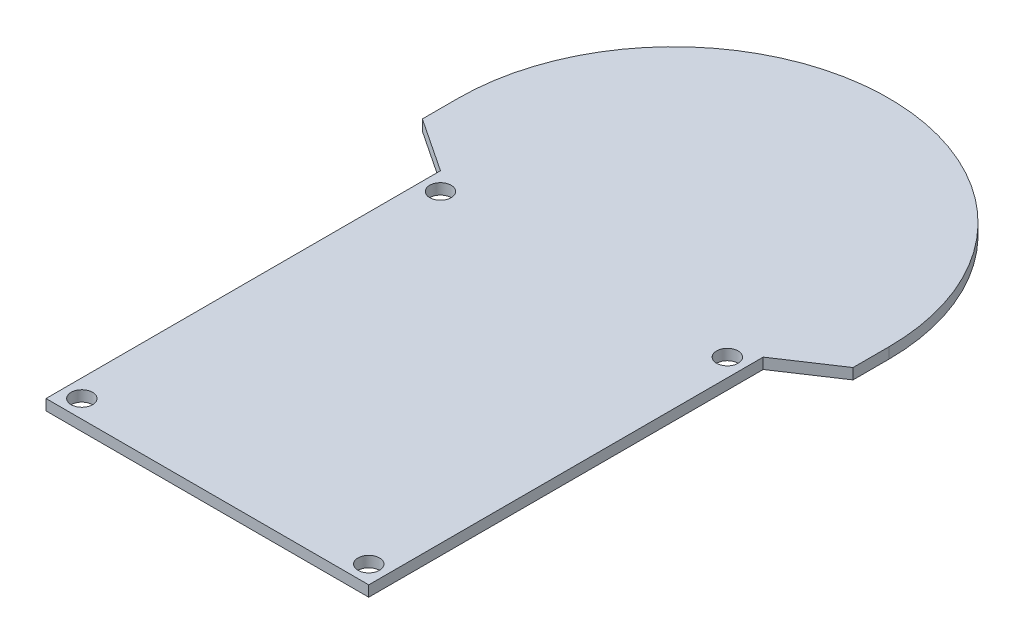
ISO-10303-21;
HEADER;
FILE_DESCRIPTION(('STEP AP214'),'2;1');
FILE_NAME('part.step','',(''),(''),'','','');
FILE_SCHEMA(('AUTOMOTIVE_DESIGN { 1 0 10303 214 1 1 1 1 }'));
ENDSEC;
DATA;
#1=APPLICATION_CONTEXT('core data for automotive mechanical design processes');
#2=APPLICATION_PROTOCOL_DEFINITION('international standard','automotive_design',2000,#1);
#3=PRODUCT_CONTEXT('',#1,'mechanical');
#4=PRODUCT('Part','Part','',(#3));
#5=PRODUCT_RELATED_PRODUCT_CATEGORY('part','',(#4));
#6=PRODUCT_DEFINITION_FORMATION('','',#4);
#7=PRODUCT_DEFINITION_CONTEXT('part definition',#1,'design');
#8=PRODUCT_DEFINITION('design','',#6,#7);
#9=PRODUCT_DEFINITION_SHAPE('','',#8);
#10=(LENGTH_UNIT() NAMED_UNIT(*) SI_UNIT(.MILLI.,.METRE.));
#11=(NAMED_UNIT(*) PLANE_ANGLE_UNIT() SI_UNIT($,.RADIAN.));
#12=(NAMED_UNIT(*) SI_UNIT($,.STERADIAN.) SOLID_ANGLE_UNIT());
#13=UNCERTAINTY_MEASURE_WITH_UNIT(LENGTH_MEASURE(1.E-05),#10,'distance_accuracy_value','');
#14=(GEOMETRIC_REPRESENTATION_CONTEXT(3) GLOBAL_UNCERTAINTY_ASSIGNED_CONTEXT((#13)) GLOBAL_UNIT_ASSIGNED_CONTEXT((#10,
#11,#12)) REPRESENTATION_CONTEXT('',''));
#15=CARTESIAN_POINT('',(0.,0.,0.));
#16=DIRECTION('',(0.,0.,1.));
#17=DIRECTION('',(1.,0.,0.));
#18=AXIS2_PLACEMENT_3D('',#15,#16,#17);
#19=CARTESIAN_POINT('',(7.5,1.5,22.5));
#20=DIRECTION('',(-1.,0.,0.));
#21=DIRECTION('',(0.,0.,1.));
#22=AXIS2_PLACEMENT_3D('',#19,#20,#21);
#23=PLANE('',#22);
#24=DIRECTION('',(0.,0.,-1.));
#25=VECTOR('',#24,1.);
#26=CARTESIAN_POINT('',(7.5,0.,22.5));
#27=LINE('',#26,#25);
#28=CARTESIAN_POINT('',(7.5,0.,22.5));
#29=VERTEX_POINT('',#28);
#30=CARTESIAN_POINT('',(7.50000000000001,0.,-32.5));
#31=VERTEX_POINT('',#30);
#32=EDGE_CURVE('E131',#29,#31,#27,.T.);
#33=ORIENTED_EDGE('',*,*,#32,.T.);
#34=DIRECTION('',(0.,-1.,0.));
#35=VECTOR('',#34,1.);
#36=CARTESIAN_POINT('',(7.50000000000001,1.5,-32.5));
#37=LINE('',#36,#35);
#38=CARTESIAN_POINT('',(7.50000000000001,1.5,-32.5));
#39=VERTEX_POINT('',#38);
#40=EDGE_CURVE('E11',#39,#31,#37,.T.);
#41=ORIENTED_EDGE('',*,*,#40,.F.);
#42=DIRECTION('',(0.,0.,-1.));
#43=VECTOR('',#42,1.);
#44=CARTESIAN_POINT('',(7.5,1.5,22.5));
#45=LINE('',#44,#43);
#46=CARTESIAN_POINT('',(7.5,1.5,22.5));
#47=VERTEX_POINT('',#46);
#48=EDGE_CURVE('E146',#47,#39,#45,.T.);
#49=ORIENTED_EDGE('',*,*,#48,.F.);
#50=DIRECTION('',(0.,-1.,0.));
#51=VECTOR('',#50,1.);
#52=CARTESIAN_POINT('',(7.5,1.5,22.5));
#53=LINE('',#52,#51);
#54=EDGE_CURVE('E127',#47,#29,#53,.T.);
#55=ORIENTED_EDGE('',*,*,#54,.T.);
#56=EDGE_LOOP('',(#33,#41,#49,#55));
#57=FACE_BOUND('',#56,.T.);
#58=ADVANCED_FACE('F35',(#57),#23,.F.);
#59=CARTESIAN_POINT('',(15.021006533252,1.5,-37.5));
#60=DIRECTION('',(-0.553626217534285,0.,-0.832765279810993));
#61=DIRECTION('',(-0.832765279810993,0.,0.553626217534285));
#62=AXIS2_PLACEMENT_3D('',#59,#60,#61);
#63=PLANE('',#62);
#64=DIRECTION('',(0.832765279810993,0.,-0.553626217534285));
#65=VECTOR('',#64,1.);
#66=CARTESIAN_POINT('',(15.021006533252,0.,-37.5));
#67=LINE('',#66,#65);
#68=CARTESIAN_POINT('',(15.021006533252,0.,-37.5));
#69=VERTEX_POINT('',#68);
#70=EDGE_CURVE('E134',#31,#69,#67,.T.);
#71=ORIENTED_EDGE('',*,*,#70,.T.);
#72=DIRECTION('',(0.,-1.,0.));
#73=VECTOR('',#72,1.);
#74=CARTESIAN_POINT('',(15.021006533252,1.5,-37.5));
#75=LINE('',#74,#73);
#76=CARTESIAN_POINT('',(15.021006533252,1.5,-37.5));
#77=VERTEX_POINT('',#76);
#78=EDGE_CURVE('E43',#77,#69,#75,.T.);
#79=ORIENTED_EDGE('',*,*,#78,.F.);
#80=DIRECTION('',(0.832765279810993,0.,-0.553626217534285));
#81=VECTOR('',#80,1.);
#82=CARTESIAN_POINT('',(15.021006533252,1.5,-37.5));
#83=LINE('',#82,#81);
#84=EDGE_CURVE('E94',#39,#77,#83,.T.);
#85=ORIENTED_EDGE('',*,*,#84,.F.);
#86=ORIENTED_EDGE('',*,*,#40,.T.);
#87=EDGE_LOOP('',(#71,#79,#85,#86));
#88=FACE_BOUND('',#87,.T.);
#89=ADVANCED_FACE('F236',(#88),#63,.F.);
#90=CARTESIAN_POINT('',(15.021006533252,1.5,-42.5));
#91=DIRECTION('',(-1.,0.,0.));
#92=DIRECTION('',(0.,0.,1.));
#93=AXIS2_PLACEMENT_3D('',#90,#91,#92);
#94=PLANE('',#93);
#95=DIRECTION('',(0.,0.,-1.));
#96=VECTOR('',#95,1.);
#97=CARTESIAN_POINT('',(15.021006533252,0.,-42.5));
#98=LINE('',#97,#96);
#99=CARTESIAN_POINT('',(15.021006533252,0.,-42.5));
#100=VERTEX_POINT('',#99);
#101=EDGE_CURVE('E137',#69,#100,#98,.T.);
#102=ORIENTED_EDGE('',*,*,#101,.T.);
#103=DIRECTION('',(0.,-1.,0.));
#104=VECTOR('',#103,1.);
#105=CARTESIAN_POINT('',(15.021006533252,1.5,-42.5));
#106=LINE('',#105,#104);
#107=CARTESIAN_POINT('',(15.021006533252,1.5,-42.5));
#108=VERTEX_POINT('',#107);
#109=EDGE_CURVE('E153',#108,#100,#106,.T.);
#110=ORIENTED_EDGE('',*,*,#109,.F.);
#111=DIRECTION('',(0.,0.,-1.));
#112=VECTOR('',#111,1.);
#113=CARTESIAN_POINT('',(15.021006533252,1.5,-42.5));
#114=LINE('',#113,#112);
#115=EDGE_CURVE('E161',#77,#108,#114,.T.);
#116=ORIENTED_EDGE('',*,*,#115,.F.);
#117=ORIENTED_EDGE('',*,*,#78,.T.);
#118=EDGE_LOOP('',(#102,#110,#116,#117));
#119=FACE_BOUND('',#118,.T.);
#120=ADVANCED_FACE('F159',(#119),#94,.F.);
#121=CARTESIAN_POINT('',(-15.,1.5,-42.5));
#122=DIRECTION('',(0.,-1.,0.));
#123=DIRECTION('',(0.,0.,-1.));
#124=AXIS2_PLACEMENT_3D('',#121,#122,#123);
#125=CYLINDRICAL_SURFACE('',#124,30.021006533252);
#126=CARTESIAN_POINT('',(-15.,0.,-42.5));
#127=DIRECTION('',(0.,1.,0.));
#128=DIRECTION('',(0.,0.,1.));
#129=AXIS2_PLACEMENT_3D('',#126,#127,#128);
#130=CIRCLE('',#129,30.021006533252);
#131=CARTESIAN_POINT('',(-45.021006533252,0.,-42.5));
#132=VERTEX_POINT('',#131);
#133=EDGE_CURVE('E139',#100,#132,#130,.T.);
#134=ORIENTED_EDGE('',*,*,#133,.T.);
#135=DIRECTION('',(0.,-1.,0.));
#136=VECTOR('',#135,1.);
#137=CARTESIAN_POINT('',(-45.021006533252,1.5,-42.5));
#138=LINE('',#137,#136);
#139=CARTESIAN_POINT('',(-45.021006533252,1.5,-42.5));
#140=VERTEX_POINT('',#139);
#141=EDGE_CURVE('E150',#140,#132,#138,.T.);
#142=ORIENTED_EDGE('',*,*,#141,.F.);
#143=CARTESIAN_POINT('',(-15.,1.5,-42.5));
#144=DIRECTION('',(0.,1.,0.));
#145=DIRECTION('',(0.,0.,1.));
#146=AXIS2_PLACEMENT_3D('',#143,#144,#145);
#147=CIRCLE('',#146,30.021006533252);
#148=EDGE_CURVE('E173',#108,#140,#147,.T.);
#149=ORIENTED_EDGE('',*,*,#148,.F.);
#150=ORIENTED_EDGE('',*,*,#109,.T.);
#151=EDGE_LOOP('',(#134,#142,#149,#150));
#152=FACE_BOUND('',#151,.T.);
#153=ADVANCED_FACE('F169',(#152),#125,.T.);
#154=CARTESIAN_POINT('',(-45.021006533252,1.5,-42.5));
#155=DIRECTION('',(1.,0.,0.));
#156=DIRECTION('',(0.,0.,-1.));
#157=AXIS2_PLACEMENT_3D('',#154,#155,#156);
#158=PLANE('',#157);
#159=DIRECTION('',(0.,0.,1.));
#160=VECTOR('',#159,1.);
#161=CARTESIAN_POINT('',(-45.021006533252,0.,-42.5));
#162=LINE('',#161,#160);
#163=CARTESIAN_POINT('',(-45.021006533252,0.,-37.5));
#164=VERTEX_POINT('',#163);
#165=EDGE_CURVE('E141',#132,#164,#162,.T.);
#166=ORIENTED_EDGE('',*,*,#165,.T.);
#167=DIRECTION('',(0.,-1.,0.));
#168=VECTOR('',#167,1.);
#169=CARTESIAN_POINT('',(-45.021006533252,1.5,-37.5));
#170=LINE('',#169,#168);
#171=CARTESIAN_POINT('',(-45.021006533252,1.5,-37.5));
#172=VERTEX_POINT('',#171);
#173=EDGE_CURVE('E122',#172,#164,#170,.T.);
#174=ORIENTED_EDGE('',*,*,#173,.F.);
#175=DIRECTION('',(0.,0.,1.));
#176=VECTOR('',#175,1.);
#177=CARTESIAN_POINT('',(-45.021006533252,1.5,-42.5));
#178=LINE('',#177,#176);
#179=EDGE_CURVE('E113',#140,#172,#178,.T.);
#180=ORIENTED_EDGE('',*,*,#179,.F.);
#181=ORIENTED_EDGE('',*,*,#141,.T.);
#182=EDGE_LOOP('',(#166,#174,#180,#181));
#183=FACE_BOUND('',#182,.T.);
#184=ADVANCED_FACE('F172',(#183),#158,.F.);
#185=CARTESIAN_POINT('',(-45.021006533252,1.5,-37.5));
#186=DIRECTION('',(0.553626217534284,0.,-0.832765279810993));
#187=DIRECTION('',(-0.832765279810993,0.,-0.553626217534284));
#188=AXIS2_PLACEMENT_3D('',#185,#186,#187);
#189=PLANE('',#188);
#190=DIRECTION('',(0.832765279810993,0.,0.553626217534284));
#191=VECTOR('',#190,1.);
#192=CARTESIAN_POINT('',(-45.021006533252,0.,-37.5));
#193=LINE('',#192,#191);
#194=CARTESIAN_POINT('',(-37.5,0.,-32.5));
#195=VERTEX_POINT('',#194);
#196=EDGE_CURVE('E121',#164,#195,#193,.T.);
#197=ORIENTED_EDGE('',*,*,#196,.T.);
#198=DIRECTION('',(0.,-1.,0.));
#199=VECTOR('',#198,1.);
#200=CARTESIAN_POINT('',(-37.5,1.5,-32.5));
#201=LINE('',#200,#199);
#202=CARTESIAN_POINT('',(-37.5,1.5,-32.5));
#203=VERTEX_POINT('',#202);
#204=EDGE_CURVE('E118',#203,#195,#201,.T.);
#205=ORIENTED_EDGE('',*,*,#204,.F.);
#206=DIRECTION('',(0.832765279810993,0.,0.553626217534284));
#207=VECTOR('',#206,1.);
#208=CARTESIAN_POINT('',(-45.021006533252,1.5,-37.5));
#209=LINE('',#208,#207);
#210=EDGE_CURVE('E107',#172,#203,#209,.T.);
#211=ORIENTED_EDGE('',*,*,#210,.F.);
#212=ORIENTED_EDGE('',*,*,#173,.T.);
#213=EDGE_LOOP('',(#197,#205,#211,#212));
#214=FACE_BOUND('',#213,.T.);
#215=ADVANCED_FACE('F119',(#214),#189,.F.);
#216=CARTESIAN_POINT('',(-37.5,1.5,22.5));
#217=DIRECTION('',(1.,0.,0.));
#218=DIRECTION('',(0.,0.,-1.));
#219=AXIS2_PLACEMENT_3D('',#216,#217,#218);
#220=PLANE('',#219);
#221=DIRECTION('',(0.,0.,1.));
#222=VECTOR('',#221,1.);
#223=CARTESIAN_POINT('',(-37.5,0.,22.5));
#224=LINE('',#223,#222);
#225=CARTESIAN_POINT('',(-37.5,0.,22.5));
#226=VERTEX_POINT('',#225);
#227=EDGE_CURVE('E80',#195,#226,#224,.T.);
#228=ORIENTED_EDGE('',*,*,#227,.T.);
#229=DIRECTION('',(0.,-1.,0.));
#230=VECTOR('',#229,1.);
#231=CARTESIAN_POINT('',(-37.5,1.5,22.5));
#232=LINE('',#231,#230);
#233=CARTESIAN_POINT('',(-37.5,1.5,22.5));
#234=VERTEX_POINT('',#233);
#235=EDGE_CURVE('E123',#234,#226,#232,.T.);
#236=ORIENTED_EDGE('',*,*,#235,.F.);
#237=DIRECTION('',(0.,0.,1.));
#238=VECTOR('',#237,1.);
#239=CARTESIAN_POINT('',(-37.5,1.5,22.5));
#240=LINE('',#239,#238);
#241=EDGE_CURVE('E111',#203,#234,#240,.T.);
#242=ORIENTED_EDGE('',*,*,#241,.F.);
#243=ORIENTED_EDGE('',*,*,#204,.T.);
#244=EDGE_LOOP('',(#228,#236,#242,#243));
#245=FACE_BOUND('',#244,.T.);
#246=ADVANCED_FACE('F125',(#245),#220,.F.);
#247=CARTESIAN_POINT('',(-37.5,1.5,22.5));
#248=DIRECTION('',(0.,0.,-1.));
#249=DIRECTION('',(-1.,0.,0.));
#250=AXIS2_PLACEMENT_3D('',#247,#248,#249);
#251=PLANE('',#250);
#252=DIRECTION('',(1.,0.,0.));
#253=VECTOR('',#252,1.);
#254=CARTESIAN_POINT('',(-37.5,0.,22.5));
#255=LINE('',#254,#253);
#256=EDGE_CURVE('E86',#226,#29,#255,.T.);
#257=ORIENTED_EDGE('',*,*,#256,.T.);
#258=ORIENTED_EDGE('',*,*,#54,.F.);
#259=DIRECTION('',(1.,0.,0.));
#260=VECTOR('',#259,1.);
#261=CARTESIAN_POINT('',(-37.5,1.5,22.5));
#262=LINE('',#261,#260);
#263=EDGE_CURVE('E51',#234,#47,#262,.T.);
#264=ORIENTED_EDGE('',*,*,#263,.F.);
#265=ORIENTED_EDGE('',*,*,#235,.T.);
#266=EDGE_LOOP('',(#257,#258,#264,#265));
#267=FACE_BOUND('',#266,.T.);
#268=ADVANCED_FACE('F214',(#267),#251,.F.);
#269=CARTESIAN_POINT('',(-15.,1.5,-42.5));
#270=DIRECTION('',(0.,1.,0.));
#271=DIRECTION('',(0.,0.,1.));
#272=AXIS2_PLACEMENT_3D('',#269,#270,#271);
#273=PLANE('',#272);
#274=CARTESIAN_POINT('',(5.,1.5,-30.));
#275=DIRECTION('',(0.,1.,0.));
#276=DIRECTION('',(0.,0.,-1.));
#277=AXIS2_PLACEMENT_3D('',#274,#275,#276);
#278=CIRCLE('',#277,1.50000000000001);
#279=CARTESIAN_POINT('',(5.,1.5,-31.5));
#280=VERTEX_POINT('',#279);
#281=EDGE_CURVE('E197',#280,#280,#278,.T.);
#282=ORIENTED_EDGE('',*,*,#281,.F.);
#283=EDGE_LOOP('',(#282));
#284=FACE_BOUND('',#283,.T.);
#285=CARTESIAN_POINT('',(5.00000000000001,1.5,20.));
#286=DIRECTION('',(0.,1.,0.));
#287=DIRECTION('',(0.,0.,-1.));
#288=AXIS2_PLACEMENT_3D('',#285,#286,#287);
#289=CIRCLE('',#288,1.50000000000001);
#290=CARTESIAN_POINT('',(5.00000000000001,1.5,18.5));
#291=VERTEX_POINT('',#290);
#292=EDGE_CURVE('E191',#291,#291,#289,.T.);
#293=ORIENTED_EDGE('',*,*,#292,.F.);
#294=EDGE_LOOP('',(#293));
#295=FACE_BOUND('',#294,.T.);
#296=CARTESIAN_POINT('',(-35.,1.5,20.));
#297=DIRECTION('',(0.,1.,0.));
#298=DIRECTION('',(0.,0.,1.));
#299=AXIS2_PLACEMENT_3D('',#296,#297,#298);
#300=CIRCLE('',#299,1.5);
#301=CARTESIAN_POINT('',(-35.,1.5,21.5));
#302=VERTEX_POINT('',#301);
#303=EDGE_CURVE('E185',#302,#302,#300,.T.);
#304=ORIENTED_EDGE('',*,*,#303,.F.);
#305=EDGE_LOOP('',(#304));
#306=FACE_BOUND('',#305,.T.);
#307=CARTESIAN_POINT('',(-35.,1.5,-30.));
#308=DIRECTION('',(0.,1.,0.));
#309=DIRECTION('',(0.,0.,1.));
#310=AXIS2_PLACEMENT_3D('',#307,#308,#309);
#311=CIRCLE('',#310,1.5);
#312=CARTESIAN_POINT('',(-35.,1.5,-28.5));
#313=VERTEX_POINT('',#312);
#314=EDGE_CURVE('E179',#313,#313,#311,.T.);
#315=ORIENTED_EDGE('',*,*,#314,.F.);
#316=EDGE_LOOP('',(#315));
#317=FACE_BOUND('',#316,.T.);
#318=ORIENTED_EDGE('',*,*,#48,.T.);
#319=ORIENTED_EDGE('',*,*,#84,.T.);
#320=ORIENTED_EDGE('',*,*,#115,.T.);
#321=ORIENTED_EDGE('',*,*,#148,.T.);
#322=ORIENTED_EDGE('',*,*,#179,.T.);
#323=ORIENTED_EDGE('',*,*,#210,.T.);
#324=ORIENTED_EDGE('',*,*,#241,.T.);
#325=ORIENTED_EDGE('',*,*,#263,.T.);
#326=EDGE_LOOP('',(#318,#319,#320,#321,#322,#323,#324,#325));
#327=FACE_BOUND('',#326,.T.);
#328=ADVANCED_FACE('F109',(#284,#295,#306,#317,#327),#273,.T.);
#329=CARTESIAN_POINT('',(-15.,0.,-42.5));
#330=DIRECTION('',(0.,1.,0.));
#331=DIRECTION('',(0.,0.,1.));
#332=AXIS2_PLACEMENT_3D('',#329,#330,#331);
#333=PLANE('',#332);
#334=CARTESIAN_POINT('',(5.,0.,-30.));
#335=DIRECTION('',(0.,1.,0.));
#336=DIRECTION('',(0.,0.,-1.));
#337=AXIS2_PLACEMENT_3D('',#334,#335,#336);
#338=CIRCLE('',#337,1.50000000000001);
#339=CARTESIAN_POINT('',(5.,0.,-31.5));
#340=VERTEX_POINT('',#339);
#341=EDGE_CURVE('E194',#340,#340,#338,.T.);
#342=ORIENTED_EDGE('',*,*,#341,.T.);
#343=EDGE_LOOP('',(#342));
#344=FACE_BOUND('',#343,.T.);
#345=CARTESIAN_POINT('',(5.00000000000001,0.,20.));
#346=DIRECTION('',(0.,1.,0.));
#347=DIRECTION('',(0.,0.,-1.));
#348=AXIS2_PLACEMENT_3D('',#345,#346,#347);
#349=CIRCLE('',#348,1.50000000000001);
#350=CARTESIAN_POINT('',(5.00000000000001,0.,18.5));
#351=VERTEX_POINT('',#350);
#352=EDGE_CURVE('E188',#351,#351,#349,.T.);
#353=ORIENTED_EDGE('',*,*,#352,.T.);
#354=EDGE_LOOP('',(#353));
#355=FACE_BOUND('',#354,.T.);
#356=CARTESIAN_POINT('',(-35.,0.,20.));
#357=DIRECTION('',(0.,1.,0.));
#358=DIRECTION('',(0.,0.,1.));
#359=AXIS2_PLACEMENT_3D('',#356,#357,#358);
#360=CIRCLE('',#359,1.5);
#361=CARTESIAN_POINT('',(-35.,0.,21.5));
#362=VERTEX_POINT('',#361);
#363=EDGE_CURVE('E182',#362,#362,#360,.T.);
#364=ORIENTED_EDGE('',*,*,#363,.T.);
#365=EDGE_LOOP('',(#364));
#366=FACE_BOUND('',#365,.T.);
#367=CARTESIAN_POINT('',(-35.,0.,-30.));
#368=DIRECTION('',(0.,1.,0.));
#369=DIRECTION('',(0.,0.,1.));
#370=AXIS2_PLACEMENT_3D('',#367,#368,#369);
#371=CIRCLE('',#370,1.5);
#372=CARTESIAN_POINT('',(-35.,0.,-28.5));
#373=VERTEX_POINT('',#372);
#374=EDGE_CURVE('E135',#373,#373,#371,.T.);
#375=ORIENTED_EDGE('',*,*,#374,.T.);
#376=EDGE_LOOP('',(#375));
#377=FACE_BOUND('',#376,.T.);
#378=ORIENTED_EDGE('',*,*,#32,.F.);
#379=ORIENTED_EDGE('',*,*,#256,.F.);
#380=ORIENTED_EDGE('',*,*,#227,.F.);
#381=ORIENTED_EDGE('',*,*,#196,.F.);
#382=ORIENTED_EDGE('',*,*,#165,.F.);
#383=ORIENTED_EDGE('',*,*,#133,.F.);
#384=ORIENTED_EDGE('',*,*,#101,.F.);
#385=ORIENTED_EDGE('',*,*,#70,.F.);
#386=EDGE_LOOP('',(#378,#379,#380,#381,#382,#383,#384,#385));
#387=FACE_BOUND('',#386,.T.);
#388=ADVANCED_FACE('F165',(#344,#355,#366,#377,#387),#333,.F.);
#389=CARTESIAN_POINT('',(-35.,0.,-30.));
#390=DIRECTION('',(0.,1.,0.));
#391=DIRECTION('',(0.,0.,1.));
#392=AXIS2_PLACEMENT_3D('',#389,#390,#391);
#393=CYLINDRICAL_SURFACE('',#392,1.5);
#394=ORIENTED_EDGE('',*,*,#374,.F.);
#395=EDGE_LOOP('',(#394));
#396=FACE_BOUND('',#395,.T.);
#397=ORIENTED_EDGE('',*,*,#314,.T.);
#398=EDGE_LOOP('',(#397));
#399=FACE_BOUND('',#398,.T.);
#400=ADVANCED_FACE('F222',(#396,#399),#393,.F.);
#401=CARTESIAN_POINT('',(-35.,0.,20.));
#402=DIRECTION('',(0.,1.,0.));
#403=DIRECTION('',(0.,0.,1.));
#404=AXIS2_PLACEMENT_3D('',#401,#402,#403);
#405=CYLINDRICAL_SURFACE('',#404,1.5);
#406=ORIENTED_EDGE('',*,*,#363,.F.);
#407=EDGE_LOOP('',(#406));
#408=FACE_BOUND('',#407,.T.);
#409=ORIENTED_EDGE('',*,*,#303,.T.);
#410=EDGE_LOOP('',(#409));
#411=FACE_BOUND('',#410,.T.);
#412=ADVANCED_FACE('F224',(#408,#411),#405,.F.);
#413=CARTESIAN_POINT('',(5.00000000000001,0.,20.));
#414=DIRECTION('',(0.,1.,0.));
#415=DIRECTION('',(0.,0.,1.));
#416=AXIS2_PLACEMENT_3D('',#413,#414,#415);
#417=CYLINDRICAL_SURFACE('',#416,1.50000000000001);
#418=ORIENTED_EDGE('',*,*,#352,.F.);
#419=EDGE_LOOP('',(#418));
#420=FACE_BOUND('',#419,.T.);
#421=ORIENTED_EDGE('',*,*,#292,.T.);
#422=EDGE_LOOP('',(#421));
#423=FACE_BOUND('',#422,.T.);
#424=ADVANCED_FACE('F208',(#420,#423),#417,.F.);
#425=CARTESIAN_POINT('',(5.,0.,-30.));
#426=DIRECTION('',(0.,1.,0.));
#427=DIRECTION('',(0.,0.,1.));
#428=AXIS2_PLACEMENT_3D('',#425,#426,#427);
#429=CYLINDRICAL_SURFACE('',#428,1.50000000000001);
#430=ORIENTED_EDGE('',*,*,#341,.F.);
#431=EDGE_LOOP('',(#430));
#432=FACE_BOUND('',#431,.T.);
#433=ORIENTED_EDGE('',*,*,#281,.T.);
#434=EDGE_LOOP('',(#433));
#435=FACE_BOUND('',#434,.T.);
#436=ADVANCED_FACE('F205',(#432,#435),#429,.F.);
#437=CLOSED_SHELL('',(#58,#89,#120,#153,#184,#215,#246,#268,#328,#388,#400,#412,#424,#436));
#438=MANIFOLD_SOLID_BREP('B2',#437);
#439=ADVANCED_BREP_SHAPE_REPRESENTATION('',(#18,#438),#14);
#440=SHAPE_DEFINITION_REPRESENTATION(#9,#439);
ENDSEC;
END-ISO-10303-21;
